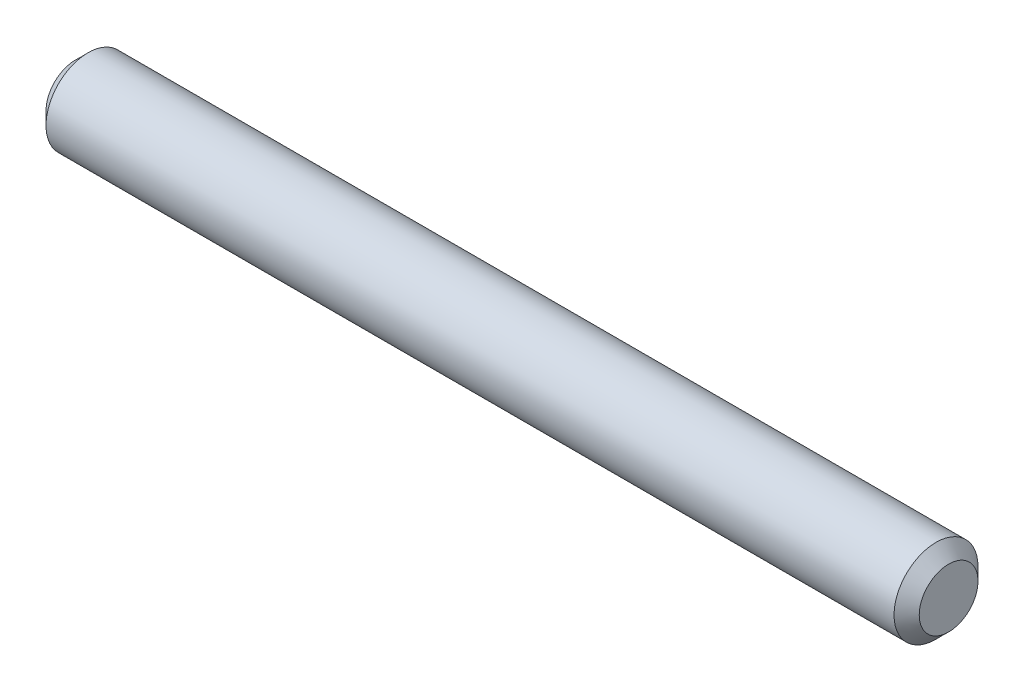
ISO-10303-21;
HEADER;
FILE_DESCRIPTION(('STEP AP214'),'2;1');
FILE_NAME('part.step','',(''),(''),'','','');
FILE_SCHEMA(('AUTOMOTIVE_DESIGN { 1 0 10303 214 1 1 1 1 }'));
ENDSEC;
DATA;
#1=APPLICATION_CONTEXT('core data for automotive mechanical design processes');
#2=APPLICATION_PROTOCOL_DEFINITION('international standard','automotive_design',2000,#1);
#3=PRODUCT_CONTEXT('',#1,'mechanical');
#4=PRODUCT('Part','Part','',(#3));
#5=PRODUCT_RELATED_PRODUCT_CATEGORY('part','',(#4));
#6=PRODUCT_DEFINITION_FORMATION('','',#4);
#7=PRODUCT_DEFINITION_CONTEXT('part definition',#1,'design');
#8=PRODUCT_DEFINITION('design','',#6,#7);
#9=PRODUCT_DEFINITION_SHAPE('','',#8);
#10=(LENGTH_UNIT() NAMED_UNIT(*) SI_UNIT(.MILLI.,.METRE.));
#11=(NAMED_UNIT(*) PLANE_ANGLE_UNIT() SI_UNIT($,.RADIAN.));
#12=(NAMED_UNIT(*) SI_UNIT($,.STERADIAN.) SOLID_ANGLE_UNIT());
#13=UNCERTAINTY_MEASURE_WITH_UNIT(LENGTH_MEASURE(1.E-05),#10,'distance_accuracy_value','');
#14=(GEOMETRIC_REPRESENTATION_CONTEXT(3) GLOBAL_UNCERTAINTY_ASSIGNED_CONTEXT((#13)) GLOBAL_UNIT_ASSIGNED_CONTEXT((#10,
#11,#12)) REPRESENTATION_CONTEXT('',''));
#15=CARTESIAN_POINT('',(0.,0.,0.));
#16=DIRECTION('',(0.,0.,1.));
#17=DIRECTION('',(1.,0.,0.));
#18=AXIS2_PLACEMENT_3D('',#15,#16,#17);
#19=CARTESIAN_POINT('',(-10.4,0.,0.));
#20=DIRECTION('',(1.,0.,0.));
#21=DIRECTION('',(0.,0.,-1.));
#22=AXIS2_PLACEMENT_3D('',#19,#20,#21);
#23=PLANE('',#22);
#24=CARTESIAN_POINT('',(-10.4000000000042,0.,0.));
#25=DIRECTION('',(1.,0.,0.));
#26=DIRECTION('',(0.,0.,-1.));
#27=AXIS2_PLACEMENT_3D('',#24,#25,#26);
#28=CIRCLE('',#27,0.699991334101923);
#29=CARTESIAN_POINT('',(-10.4000000000042,0.,-0.699991334101923));
#30=VERTEX_POINT('',#29);
#31=EDGE_CURVE('E18',#30,#30,#28,.T.);
#32=ORIENTED_EDGE('',*,*,#31,.F.);
#33=EDGE_LOOP('',(#32));
#34=FACE_BOUND('',#33,.T.);
#35=ADVANCED_FACE('F15',(#34),#23,.F.);
#36=CARTESIAN_POINT('',(10.4,0.,0.));
#37=DIRECTION('',(1.,0.,0.));
#38=DIRECTION('',(0.,0.,-1.));
#39=AXIS2_PLACEMENT_3D('',#36,#37,#38);
#40=PLANE('',#39);
#41=CARTESIAN_POINT('',(10.4000000000042,0.,0.));
#42=DIRECTION('',(-1.,0.,0.));
#43=DIRECTION('',(0.,0.,1.));
#44=AXIS2_PLACEMENT_3D('',#41,#42,#43);
#45=CIRCLE('',#44,0.699991334101923);
#46=CARTESIAN_POINT('',(10.4000000000042,0.,0.699991334101923));
#47=VERTEX_POINT('',#46);
#48=EDGE_CURVE('E27',#47,#47,#45,.T.);
#49=ORIENTED_EDGE('',*,*,#48,.F.);
#50=EDGE_LOOP('',(#49));
#51=FACE_BOUND('',#50,.T.);
#52=ADVANCED_FACE('F38',(#51),#40,.T.);
#53=CARTESIAN_POINT('',(-10.0999876200945,0.,0.));
#54=DIRECTION('',(1.,0.,0.));
#55=DIRECTION('',(0.,0.,-1.));
#56=AXIS2_PLACEMENT_3D('',#53,#54,#55);
#57=CONICAL_SURFACE('',#56,0.99999999991951,0.785391973460994);
#58=CARTESIAN_POINT('',(-10.0999876200055,0.,0.));
#59=DIRECTION('',(1.,0.,0.));
#60=DIRECTION('',(0.,0.,-1.));
#61=AXIS2_PLACEMENT_3D('',#58,#59,#60);
#62=CIRCLE('',#61,1.);
#63=CARTESIAN_POINT('',(-10.0999876200055,0.,-1.));
#64=VERTEX_POINT('',#63);
#65=EDGE_CURVE('E22',#64,#64,#62,.T.);
#66=ORIENTED_EDGE('',*,*,#65,.F.);
#67=EDGE_LOOP('',(#66));
#68=FACE_BOUND('',#67,.T.);
#69=ORIENTED_EDGE('',*,*,#31,.T.);
#70=EDGE_LOOP('',(#69));
#71=FACE_BOUND('',#70,.T.);
#72=ADVANCED_FACE('F35',(#68,#71),#57,.T.);
#73=CARTESIAN_POINT('',(10.0999876200945,0.,0.));
#74=DIRECTION('',(-1.,0.,0.));
#75=DIRECTION('',(0.,0.,1.));
#76=AXIS2_PLACEMENT_3D('',#73,#74,#75);
#77=CONICAL_SURFACE('',#76,0.99999999991951,0.785391973460994);
#78=CARTESIAN_POINT('',(10.0999876200055,0.,0.));
#79=DIRECTION('',(1.,0.,0.));
#80=DIRECTION('',(0.,0.,-1.));
#81=AXIS2_PLACEMENT_3D('',#78,#79,#80);
#82=CIRCLE('',#81,1.);
#83=CARTESIAN_POINT('',(10.0999876200055,0.,-1.));
#84=VERTEX_POINT('',#83);
#85=EDGE_CURVE('E10',#84,#84,#82,.F.);
#86=ORIENTED_EDGE('',*,*,#85,.F.);
#87=EDGE_LOOP('',(#86));
#88=FACE_BOUND('',#87,.T.);
#89=ORIENTED_EDGE('',*,*,#48,.T.);
#90=EDGE_LOOP('',(#89));
#91=FACE_BOUND('',#90,.T.);
#92=ADVANCED_FACE('F46',(#88,#91),#77,.T.);
#93=CARTESIAN_POINT('',(-10.4,0.,0.));
#94=DIRECTION('',(1.,0.,0.));
#95=DIRECTION('',(0.,0.,-1.));
#96=AXIS2_PLACEMENT_3D('',#93,#94,#95);
#97=CYLINDRICAL_SURFACE('',#96,1.);
#98=ORIENTED_EDGE('',*,*,#85,.T.);
#99=EDGE_LOOP('',(#98));
#100=FACE_BOUND('',#99,.T.);
#101=ORIENTED_EDGE('',*,*,#65,.T.);
#102=EDGE_LOOP('',(#101));
#103=FACE_BOUND('',#102,.T.);
#104=ADVANCED_FACE('F44',(#100,#103),#97,.T.);
#105=CLOSED_SHELL('',(#35,#52,#72,#92,#104));
#106=MANIFOLD_SOLID_BREP('B1',#105);
#107=ADVANCED_BREP_SHAPE_REPRESENTATION('',(#18,#106),#14);
#108=SHAPE_DEFINITION_REPRESENTATION(#9,#107);
ENDSEC;
END-ISO-10303-21;
